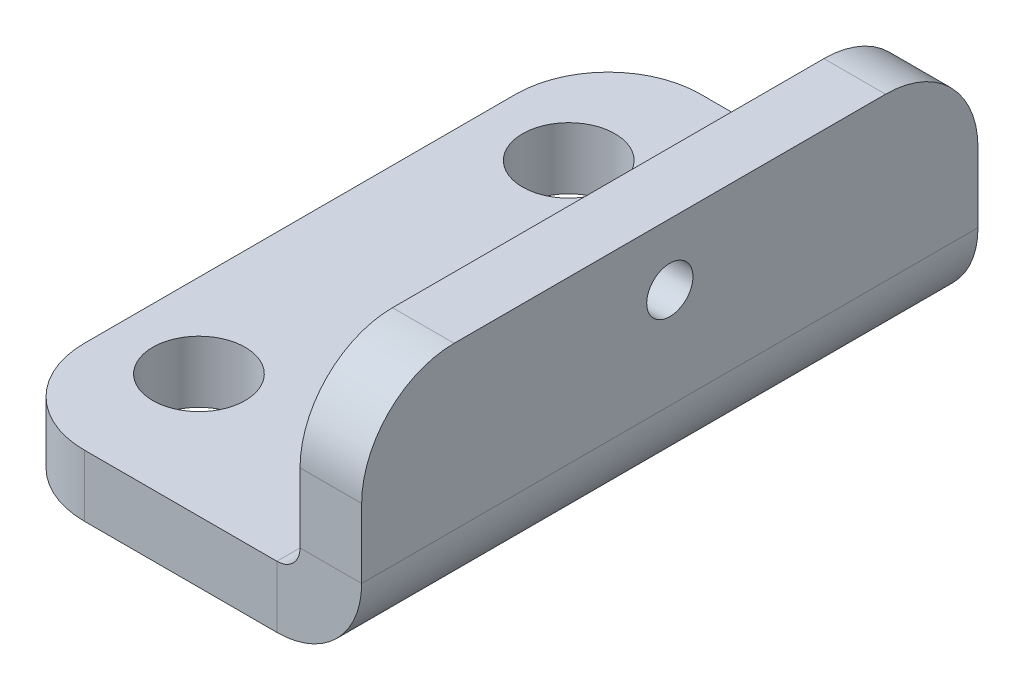
ISO-10303-21;
HEADER;
FILE_DESCRIPTION(('STEP AP214'),'2;1');
FILE_NAME('part.step','',(''),(''),'','','');
FILE_SCHEMA(('AUTOMOTIVE_DESIGN { 1 0 10303 214 1 1 1 1 }'));
ENDSEC;
DATA;
#1=APPLICATION_CONTEXT('core data for automotive mechanical design processes');
#2=APPLICATION_PROTOCOL_DEFINITION('international standard','automotive_design',2000,#1);
#3=PRODUCT_CONTEXT('',#1,'mechanical');
#4=PRODUCT('Part','Part','',(#3));
#5=PRODUCT_RELATED_PRODUCT_CATEGORY('part','',(#4));
#6=PRODUCT_DEFINITION_FORMATION('','',#4);
#7=PRODUCT_DEFINITION_CONTEXT('part definition',#1,'design');
#8=PRODUCT_DEFINITION('design','',#6,#7);
#9=PRODUCT_DEFINITION_SHAPE('','',#8);
#10=(LENGTH_UNIT() NAMED_UNIT(*) SI_UNIT(.MILLI.,.METRE.));
#11=(NAMED_UNIT(*) PLANE_ANGLE_UNIT() SI_UNIT($,.RADIAN.));
#12=(NAMED_UNIT(*) SI_UNIT($,.STERADIAN.) SOLID_ANGLE_UNIT());
#13=UNCERTAINTY_MEASURE_WITH_UNIT(LENGTH_MEASURE(1.E-05),#10,'distance_accuracy_value','');
#14=(GEOMETRIC_REPRESENTATION_CONTEXT(3) GLOBAL_UNCERTAINTY_ASSIGNED_CONTEXT((#13)) GLOBAL_UNIT_ASSIGNED_CONTEXT((#10,
#11,#12)) REPRESENTATION_CONTEXT('',''));
#15=CARTESIAN_POINT('',(0.,0.,0.));
#16=DIRECTION('',(0.,0.,1.));
#17=DIRECTION('',(1.,0.,0.));
#18=AXIS2_PLACEMENT_3D('',#15,#16,#17);
#19=CARTESIAN_POINT('',(3.,2.,7.));
#20=DIRECTION('',(0.,1.,0.));
#21=DIRECTION('',(0.,0.,1.));
#22=AXIS2_PLACEMENT_3D('',#19,#20,#21);
#23=PLANE('',#22);
#24=CARTESIAN_POINT('',(2.72,2.,-6.));
#25=DIRECTION('',(0.,1.,0.));
#26=DIRECTION('',(0.,0.,1.));
#27=AXIS2_PLACEMENT_3D('',#24,#25,#26);
#28=CIRCLE('',#27,1.5);
#29=CARTESIAN_POINT('',(2.72,2.,-4.5));
#30=VERTEX_POINT('',#29);
#31=EDGE_CURVE('E218',#30,#30,#28,.T.);
#32=ORIENTED_EDGE('',*,*,#31,.F.);
#33=EDGE_LOOP('',(#32));
#34=FACE_BOUND('',#33,.T.);
#35=CARTESIAN_POINT('',(2.72,2.,6.));
#36=DIRECTION('',(0.,1.,0.));
#37=DIRECTION('',(0.,0.,1.));
#38=AXIS2_PLACEMENT_3D('',#35,#36,#37);
#39=CIRCLE('',#38,1.5);
#40=CARTESIAN_POINT('',(2.72,2.,7.5));
#41=VERTEX_POINT('',#40);
#42=EDGE_CURVE('E212',#41,#41,#39,.T.);
#43=ORIENTED_EDGE('',*,*,#42,.F.);
#44=EDGE_LOOP('',(#43));
#45=FACE_BOUND('',#44,.T.);
#46=DIRECTION('',(1.,0.,0.));
#47=VECTOR('',#46,1.);
#48=CARTESIAN_POINT('',(3.,2.,10.));
#49=LINE('',#48,#47);
#50=CARTESIAN_POINT('',(3.,2.,10.));
#51=VERTEX_POINT('',#50);
#52=CARTESIAN_POINT('',(9.25,2.,10.));
#53=VERTEX_POINT('',#52);
#54=EDGE_CURVE('E233',#51,#53,#49,.T.);
#55=ORIENTED_EDGE('',*,*,#54,.T.);
#56=DIRECTION('',(0.,0.,-1.));
#57=VECTOR('',#56,1.);
#58=CARTESIAN_POINT('',(9.25,2.,-10.));
#59=LINE('',#58,#57);
#60=CARTESIAN_POINT('',(9.25,2.,-10.));
#61=VERTEX_POINT('',#60);
#62=EDGE_CURVE('E202',#61,#53,#59,.F.);
#63=ORIENTED_EDGE('',*,*,#62,.F.);
#64=DIRECTION('',(-1.,0.,0.));
#65=VECTOR('',#64,1.);
#66=CARTESIAN_POINT('',(3.,2.,-10.));
#67=LINE('',#66,#65);
#68=CARTESIAN_POINT('',(3.,2.,-10.));
#69=VERTEX_POINT('',#68);
#70=EDGE_CURVE('E224',#61,#69,#67,.T.);
#71=ORIENTED_EDGE('',*,*,#70,.T.);
#72=CARTESIAN_POINT('',(3.,2.,-7.));
#73=DIRECTION('',(0.,1.,0.));
#74=DIRECTION('',(0.,0.,-1.));
#75=AXIS2_PLACEMENT_3D('',#72,#73,#74);
#76=CIRCLE('',#75,3.);
#77=CARTESIAN_POINT('',(0.,2.,-7.));
#78=VERTEX_POINT('',#77);
#79=EDGE_CURVE('E226',#69,#78,#76,.T.);
#80=ORIENTED_EDGE('',*,*,#79,.T.);
#81=DIRECTION('',(0.,0.,1.));
#82=VECTOR('',#81,1.);
#83=CARTESIAN_POINT('',(0.,2.,-7.));
#84=LINE('',#83,#82);
#85=CARTESIAN_POINT('',(0.,2.,7.));
#86=VERTEX_POINT('',#85);
#87=EDGE_CURVE('E229',#78,#86,#84,.T.);
#88=ORIENTED_EDGE('',*,*,#87,.T.);
#89=CARTESIAN_POINT('',(3.,2.,7.));
#90=DIRECTION('',(0.,1.,0.));
#91=DIRECTION('',(0.,0.,1.));
#92=AXIS2_PLACEMENT_3D('',#89,#90,#91);
#93=CIRCLE('',#92,3.);
#94=EDGE_CURVE('E231',#86,#51,#93,.T.);
#95=ORIENTED_EDGE('',*,*,#94,.T.);
#96=EDGE_LOOP('',(#55,#63,#71,#80,#88,#95));
#97=FACE_BOUND('',#96,.T.);
#98=ADVANCED_FACE('F58',(#34,#45,#97),#23,.T.);
#99=CARTESIAN_POINT('',(3.,0.,7.));
#100=DIRECTION('',(0.,1.,0.));
#101=DIRECTION('',(0.,0.,1.));
#102=AXIS2_PLACEMENT_3D('',#99,#100,#101);
#103=PLANE('',#102);
#104=CARTESIAN_POINT('',(2.72,0.,6.));
#105=DIRECTION('',(0.,1.,0.));
#106=DIRECTION('',(0.,0.,1.));
#107=AXIS2_PLACEMENT_3D('',#104,#105,#106);
#108=CIRCLE('',#107,1.5);
#109=CARTESIAN_POINT('',(2.72,0.,7.5));
#110=VERTEX_POINT('',#109);
#111=EDGE_CURVE('E209',#110,#110,#108,.T.);
#112=ORIENTED_EDGE('',*,*,#111,.T.);
#113=EDGE_LOOP('',(#112));
#114=FACE_BOUND('',#113,.T.);
#115=CARTESIAN_POINT('',(2.72,0.,-6.));
#116=DIRECTION('',(0.,1.,0.));
#117=DIRECTION('',(0.,0.,1.));
#118=AXIS2_PLACEMENT_3D('',#115,#116,#117);
#119=CIRCLE('',#118,1.5);
#120=CARTESIAN_POINT('',(2.72,0.,-4.5));
#121=VERTEX_POINT('',#120);
#122=EDGE_CURVE('E215',#121,#121,#119,.T.);
#123=ORIENTED_EDGE('',*,*,#122,.T.);
#124=EDGE_LOOP('',(#123));
#125=FACE_BOUND('',#124,.T.);
#126=DIRECTION('',(0.,0.,-1.));
#127=VECTOR('',#126,1.);
#128=CARTESIAN_POINT('',(9.25,0.,-10.));
#129=LINE('',#128,#127);
#130=CARTESIAN_POINT('',(9.25,0.,-10.));
#131=VERTEX_POINT('',#130);
#132=CARTESIAN_POINT('',(9.25,0.,10.));
#133=VERTEX_POINT('',#132);
#134=EDGE_CURVE('E158',#131,#133,#129,.F.);
#135=ORIENTED_EDGE('',*,*,#134,.T.);
#136=DIRECTION('',(1.,0.,0.));
#137=VECTOR('',#136,1.);
#138=CARTESIAN_POINT('',(3.,0.,10.));
#139=LINE('',#138,#137);
#140=CARTESIAN_POINT('',(3.,0.,10.));
#141=VERTEX_POINT('',#140);
#142=EDGE_CURVE('E227',#141,#133,#139,.T.);
#143=ORIENTED_EDGE('',*,*,#142,.F.);
#144=CARTESIAN_POINT('',(3.,0.,7.));
#145=DIRECTION('',(0.,1.,0.));
#146=DIRECTION('',(0.,0.,1.));
#147=AXIS2_PLACEMENT_3D('',#144,#145,#146);
#148=CIRCLE('',#147,3.);
#149=CARTESIAN_POINT('',(0.,0.,7.));
#150=VERTEX_POINT('',#149);
#151=EDGE_CURVE('E242',#150,#141,#148,.T.);
#152=ORIENTED_EDGE('',*,*,#151,.F.);
#153=DIRECTION('',(0.,0.,1.));
#154=VECTOR('',#153,1.);
#155=CARTESIAN_POINT('',(0.,0.,-7.));
#156=LINE('',#155,#154);
#157=CARTESIAN_POINT('',(0.,0.,-7.));
#158=VERTEX_POINT('',#157);
#159=EDGE_CURVE('E240',#158,#150,#156,.T.);
#160=ORIENTED_EDGE('',*,*,#159,.F.);
#161=CARTESIAN_POINT('',(3.,0.,-7.));
#162=DIRECTION('',(0.,1.,0.));
#163=DIRECTION('',(0.,0.,-1.));
#164=AXIS2_PLACEMENT_3D('',#161,#162,#163);
#165=CIRCLE('',#164,3.);
#166=CARTESIAN_POINT('',(3.,0.,-10.));
#167=VERTEX_POINT('',#166);
#168=EDGE_CURVE('E238',#167,#158,#165,.T.);
#169=ORIENTED_EDGE('',*,*,#168,.F.);
#170=DIRECTION('',(-1.,0.,0.));
#171=VECTOR('',#170,1.);
#172=CARTESIAN_POINT('',(3.,0.,-10.));
#173=LINE('',#172,#171);
#174=EDGE_CURVE('E221',#131,#167,#173,.T.);
#175=ORIENTED_EDGE('',*,*,#174,.F.);
#176=EDGE_LOOP('',(#135,#143,#152,#160,#169,#175));
#177=FACE_BOUND('',#176,.T.);
#178=ADVANCED_FACE('F302',(#114,#125,#177),#103,.F.);
#179=CARTESIAN_POINT('',(3.,2.,-10.));
#180=DIRECTION('',(0.,0.,1.));
#181=DIRECTION('',(1.,0.,0.));
#182=AXIS2_PLACEMENT_3D('',#179,#180,#181);
#183=PLANE('',#182);
#184=DIRECTION('',(0.,-1.,0.));
#185=VECTOR('',#184,1.);
#186=CARTESIAN_POINT('',(9.25,2.,-10.));
#187=LINE('',#186,#185);
#188=EDGE_CURVE('E198',#61,#131,#187,.T.);
#189=ORIENTED_EDGE('',*,*,#188,.T.);
#190=ORIENTED_EDGE('',*,*,#174,.T.);
#191=DIRECTION('',(0.,-1.,0.));
#192=VECTOR('',#191,1.);
#193=CARTESIAN_POINT('',(3.,2.,-10.));
#194=LINE('',#193,#192);
#195=EDGE_CURVE('E253',#69,#167,#194,.T.);
#196=ORIENTED_EDGE('',*,*,#195,.F.);
#197=ORIENTED_EDGE('',*,*,#70,.F.);
#198=EDGE_LOOP('',(#189,#190,#196,#197));
#199=FACE_BOUND('',#198,.T.);
#200=ADVANCED_FACE('F307',(#199),#183,.F.);
#201=CARTESIAN_POINT('',(3.,2.,10.));
#202=DIRECTION('',(0.,0.,-1.));
#203=DIRECTION('',(-1.,0.,0.));
#204=AXIS2_PLACEMENT_3D('',#201,#202,#203);
#205=PLANE('',#204);
#206=DIRECTION('',(0.,-1.,0.));
#207=VECTOR('',#206,1.);
#208=CARTESIAN_POINT('',(9.25,2.,10.));
#209=LINE('',#208,#207);
#210=EDGE_CURVE('E206',#53,#133,#209,.T.);
#211=ORIENTED_EDGE('',*,*,#210,.F.);
#212=ORIENTED_EDGE('',*,*,#54,.F.);
#213=DIRECTION('',(0.,-1.,0.));
#214=VECTOR('',#213,1.);
#215=CARTESIAN_POINT('',(3.,2.,10.));
#216=LINE('',#215,#214);
#217=EDGE_CURVE('E236',#51,#141,#216,.T.);
#218=ORIENTED_EDGE('',*,*,#217,.T.);
#219=ORIENTED_EDGE('',*,*,#142,.T.);
#220=EDGE_LOOP('',(#211,#212,#218,#219));
#221=FACE_BOUND('',#220,.T.);
#222=ADVANCED_FACE('F290',(#221),#205,.F.);
#223=CARTESIAN_POINT('',(3.,2.,-7.));
#224=DIRECTION('',(0.,-1.,0.));
#225=DIRECTION('',(0.,0.,-1.));
#226=AXIS2_PLACEMENT_3D('',#223,#224,#225);
#227=CYLINDRICAL_SURFACE('',#226,3.);
#228=ORIENTED_EDGE('',*,*,#168,.T.);
#229=DIRECTION('',(0.,-1.,0.));
#230=VECTOR('',#229,1.);
#231=CARTESIAN_POINT('',(0.,2.,-7.));
#232=LINE('',#231,#230);
#233=EDGE_CURVE('E250',#78,#158,#232,.T.);
#234=ORIENTED_EDGE('',*,*,#233,.F.);
#235=ORIENTED_EDGE('',*,*,#79,.F.);
#236=ORIENTED_EDGE('',*,*,#195,.T.);
#237=EDGE_LOOP('',(#228,#234,#235,#236));
#238=FACE_BOUND('',#237,.T.);
#239=ADVANCED_FACE('F311',(#238),#227,.T.);
#240=CARTESIAN_POINT('',(0.,2.,-7.));
#241=DIRECTION('',(1.,0.,0.));
#242=DIRECTION('',(0.,0.,-1.));
#243=AXIS2_PLACEMENT_3D('',#240,#241,#242);
#244=PLANE('',#243);
#245=ORIENTED_EDGE('',*,*,#159,.T.);
#246=DIRECTION('',(0.,-1.,0.));
#247=VECTOR('',#246,1.);
#248=CARTESIAN_POINT('',(0.,2.,7.));
#249=LINE('',#248,#247);
#250=EDGE_CURVE('E247',#86,#150,#249,.T.);
#251=ORIENTED_EDGE('',*,*,#250,.F.);
#252=ORIENTED_EDGE('',*,*,#87,.F.);
#253=ORIENTED_EDGE('',*,*,#233,.T.);
#254=EDGE_LOOP('',(#245,#251,#252,#253));
#255=FACE_BOUND('',#254,.T.);
#256=ADVANCED_FACE('F313',(#255),#244,.F.);
#257=CARTESIAN_POINT('',(3.,2.,7.));
#258=DIRECTION('',(0.,-1.,0.));
#259=DIRECTION('',(0.,0.,-1.));
#260=AXIS2_PLACEMENT_3D('',#257,#258,#259);
#261=CYLINDRICAL_SURFACE('',#260,3.);
#262=ORIENTED_EDGE('',*,*,#151,.T.);
#263=ORIENTED_EDGE('',*,*,#217,.F.);
#264=ORIENTED_EDGE('',*,*,#94,.F.);
#265=ORIENTED_EDGE('',*,*,#250,.T.);
#266=EDGE_LOOP('',(#262,#263,#264,#265));
#267=FACE_BOUND('',#266,.T.);
#268=ADVANCED_FACE('F299',(#267),#261,.T.);
#269=CARTESIAN_POINT('',(2.72,2.,-6.));
#270=DIRECTION('',(0.,-1.,0.));
#271=DIRECTION('',(0.,0.,-1.));
#272=AXIS2_PLACEMENT_3D('',#269,#270,#271);
#273=CYLINDRICAL_SURFACE('',#272,1.5);
#274=ORIENTED_EDGE('',*,*,#31,.T.);
#275=EDGE_LOOP('',(#274));
#276=FACE_BOUND('',#275,.T.);
#277=ORIENTED_EDGE('',*,*,#122,.F.);
#278=EDGE_LOOP('',(#277));
#279=FACE_BOUND('',#278,.T.);
#280=ADVANCED_FACE('F320',(#276,#279),#273,.F.);
#281=CARTESIAN_POINT('',(2.72,2.,6.));
#282=DIRECTION('',(0.,-1.,0.));
#283=DIRECTION('',(0.,0.,-1.));
#284=AXIS2_PLACEMENT_3D('',#281,#282,#283);
#285=CYLINDRICAL_SURFACE('',#284,1.5);
#286=ORIENTED_EDGE('',*,*,#42,.T.);
#287=EDGE_LOOP('',(#286));
#288=FACE_BOUND('',#287,.T.);
#289=ORIENTED_EDGE('',*,*,#111,.F.);
#290=EDGE_LOOP('',(#289));
#291=FACE_BOUND('',#290,.T.);
#292=ADVANCED_FACE('F374',(#288,#291),#285,.F.);
#293=CARTESIAN_POINT('',(9.25,2.75,10.));
#294=DIRECTION('',(0.,0.,1.));
#295=DIRECTION('',(1.,0.,0.));
#296=AXIS2_PLACEMENT_3D('',#293,#294,#295);
#297=PLANE('',#296);
#298=DIRECTION('',(-1.,0.,0.));
#299=VECTOR('',#298,1.);
#300=CARTESIAN_POINT('',(12.,2.74999999999999,10.));
#301=LINE('',#300,#299);
#302=CARTESIAN_POINT('',(10.,2.75,10.));
#303=VERTEX_POINT('',#302);
#304=CARTESIAN_POINT('',(12.,2.74999999999999,10.));
#305=VERTEX_POINT('',#304);
#306=EDGE_CURVE('E192',#303,#305,#301,.F.);
#307=ORIENTED_EDGE('',*,*,#306,.F.);
#308=CARTESIAN_POINT('',(9.25,2.75,10.));
#309=DIRECTION('',(0.,0.,-1.));
#310=DIRECTION('',(-1.,0.,0.));
#311=AXIS2_PLACEMENT_3D('',#308,#309,#310);
#312=CIRCLE('',#311,0.750000000000002);
#313=EDGE_CURVE('E161',#53,#303,#312,.F.);
#314=ORIENTED_EDGE('',*,*,#313,.F.);
#315=ORIENTED_EDGE('',*,*,#210,.T.);
#316=CARTESIAN_POINT('',(9.25,2.75,10.));
#317=DIRECTION('',(0.,0.,-1.));
#318=DIRECTION('',(-1.,0.,0.));
#319=AXIS2_PLACEMENT_3D('',#316,#317,#318);
#320=CIRCLE('',#319,2.75);
#321=EDGE_CURVE('E197',#133,#305,#320,.F.);
#322=ORIENTED_EDGE('',*,*,#321,.T.);
#323=EDGE_LOOP('',(#307,#314,#315,#322));
#324=FACE_BOUND('',#323,.T.);
#325=ADVANCED_FACE('F287',(#324),#297,.T.);
#326=CARTESIAN_POINT('',(9.25,2.75,-10.));
#327=DIRECTION('',(0.,0.,1.));
#328=DIRECTION('',(1.,0.,0.));
#329=AXIS2_PLACEMENT_3D('',#326,#327,#328);
#330=PLANE('',#329);
#331=CARTESIAN_POINT('',(9.25,2.75,-10.));
#332=DIRECTION('',(0.,0.,-1.));
#333=DIRECTION('',(-1.,0.,0.));
#334=AXIS2_PLACEMENT_3D('',#331,#332,#333);
#335=CIRCLE('',#334,0.750000000000002);
#336=CARTESIAN_POINT('',(10.,2.75,-10.));
#337=VERTEX_POINT('',#336);
#338=EDGE_CURVE('E168',#337,#61,#335,.T.);
#339=ORIENTED_EDGE('',*,*,#338,.F.);
#340=DIRECTION('',(-1.,0.,0.));
#341=VECTOR('',#340,1.);
#342=CARTESIAN_POINT('',(10.,2.75,-10.));
#343=LINE('',#342,#341);
#344=CARTESIAN_POINT('',(12.,2.74999999999999,-10.));
#345=VERTEX_POINT('',#344);
#346=EDGE_CURVE('E165',#337,#345,#343,.F.);
#347=ORIENTED_EDGE('',*,*,#346,.T.);
#348=CARTESIAN_POINT('',(9.25,2.75,-10.));
#349=DIRECTION('',(0.,0.,-1.));
#350=DIRECTION('',(-1.,0.,0.));
#351=AXIS2_PLACEMENT_3D('',#348,#349,#350);
#352=CIRCLE('',#351,2.75);
#353=EDGE_CURVE('E150',#345,#131,#352,.T.);
#354=ORIENTED_EDGE('',*,*,#353,.T.);
#355=ORIENTED_EDGE('',*,*,#188,.F.);
#356=EDGE_LOOP('',(#339,#347,#354,#355));
#357=FACE_BOUND('',#356,.T.);
#358=ADVANCED_FACE('F166',(#357),#330,.F.);
#359=CARTESIAN_POINT('',(9.25,2.75,-10.));
#360=DIRECTION('',(0.,0.,-1.));
#361=DIRECTION('',(1.,0.,0.));
#362=AXIS2_PLACEMENT_3D('',#359,#360,#361);
#363=CYLINDRICAL_SURFACE('',#362,2.75);
#364=ORIENTED_EDGE('',*,*,#134,.F.);
#365=ORIENTED_EDGE('',*,*,#353,.F.);
#366=DIRECTION('',(0.,0.,-1.));
#367=VECTOR('',#366,1.);
#368=CARTESIAN_POINT('',(12.,2.74999999999999,10.));
#369=LINE('',#368,#367);
#370=EDGE_CURVE('E155',#345,#305,#369,.F.);
#371=ORIENTED_EDGE('',*,*,#370,.T.);
#372=ORIENTED_EDGE('',*,*,#321,.F.);
#373=EDGE_LOOP('',(#364,#365,#371,#372));
#374=FACE_BOUND('',#373,.T.);
#375=ADVANCED_FACE('F152',(#374),#363,.T.);
#376=CARTESIAN_POINT('',(9.25,2.75,-10.));
#377=DIRECTION('',(0.,0.,-1.));
#378=DIRECTION('',(1.,0.,0.));
#379=AXIS2_PLACEMENT_3D('',#376,#377,#378);
#380=CYLINDRICAL_SURFACE('',#379,0.750000000000002);
#381=ORIENTED_EDGE('',*,*,#62,.T.);
#382=ORIENTED_EDGE('',*,*,#313,.T.);
#383=DIRECTION('',(0.,0.,-1.));
#384=VECTOR('',#383,1.);
#385=CARTESIAN_POINT('',(10.,2.75,10.));
#386=LINE('',#385,#384);
#387=EDGE_CURVE('E170',#303,#337,#386,.T.);
#388=ORIENTED_EDGE('',*,*,#387,.T.);
#389=ORIENTED_EDGE('',*,*,#338,.T.);
#390=EDGE_LOOP('',(#381,#382,#388,#389));
#391=FACE_BOUND('',#390,.T.);
#392=ADVANCED_FACE('F284',(#391),#380,.F.);
#393=CARTESIAN_POINT('',(12.,8.,-10.));
#394=DIRECTION('',(0.,0.,1.));
#395=DIRECTION('',(0.,-1.,0.));
#396=AXIS2_PLACEMENT_3D('',#393,#394,#395);
#397=PLANE('',#396);
#398=DIRECTION('',(0.,-1.,0.));
#399=VECTOR('',#398,1.);
#400=CARTESIAN_POINT('',(10.,8.00000000000001,-10.));
#401=LINE('',#400,#399);
#402=CARTESIAN_POINT('',(10.,5.00000000000001,-10.));
#403=VERTEX_POINT('',#402);
#404=EDGE_CURVE('E178',#337,#403,#401,.F.);
#405=ORIENTED_EDGE('',*,*,#404,.T.);
#406=DIRECTION('',(-1.,0.,0.));
#407=VECTOR('',#406,1.);
#408=CARTESIAN_POINT('',(12.,5.,-10.));
#409=LINE('',#408,#407);
#410=CARTESIAN_POINT('',(12.,5.,-10.));
#411=VERTEX_POINT('',#410);
#412=EDGE_CURVE('E13',#403,#411,#409,.F.);
#413=ORIENTED_EDGE('',*,*,#412,.T.);
#414=DIRECTION('',(0.,1.,0.));
#415=VECTOR('',#414,1.);
#416=CARTESIAN_POINT('',(12.,0.,-10.));
#417=LINE('',#416,#415);
#418=EDGE_CURVE('E174',#345,#411,#417,.T.);
#419=ORIENTED_EDGE('',*,*,#418,.F.);
#420=ORIENTED_EDGE('',*,*,#346,.F.);
#421=EDGE_LOOP('',(#405,#413,#419,#420));
#422=FACE_BOUND('',#421,.T.);
#423=ADVANCED_FACE('F180',(#422),#397,.F.);
#424=CARTESIAN_POINT('',(12.,1.99999999999999,10.));
#425=DIRECTION('',(0.,0.,-1.));
#426=DIRECTION('',(0.,1.,0.));
#427=AXIS2_PLACEMENT_3D('',#424,#425,#426);
#428=PLANE('',#427);
#429=DIRECTION('',(0.,-1.,0.));
#430=VECTOR('',#429,1.);
#431=CARTESIAN_POINT('',(12.,0.,10.));
#432=LINE('',#431,#430);
#433=CARTESIAN_POINT('',(12.,5.,10.));
#434=VERTEX_POINT('',#433);
#435=EDGE_CURVE('E177',#434,#305,#432,.T.);
#436=ORIENTED_EDGE('',*,*,#435,.F.);
#437=DIRECTION('',(-1.,0.,0.));
#438=VECTOR('',#437,1.);
#439=CARTESIAN_POINT('',(12.,5.,10.));
#440=LINE('',#439,#438);
#441=CARTESIAN_POINT('',(10.,5.00000000000001,10.));
#442=VERTEX_POINT('',#441);
#443=EDGE_CURVE('E256',#434,#442,#440,.T.);
#444=ORIENTED_EDGE('',*,*,#443,.T.);
#445=DIRECTION('',(0.,1.,0.));
#446=VECTOR('',#445,1.);
#447=CARTESIAN_POINT('',(10.,2.,10.));
#448=LINE('',#447,#446);
#449=EDGE_CURVE('E182',#442,#303,#448,.F.);
#450=ORIENTED_EDGE('',*,*,#449,.T.);
#451=ORIENTED_EDGE('',*,*,#306,.T.);
#452=EDGE_LOOP('',(#436,#444,#450,#451));
#453=FACE_BOUND('',#452,.T.);
#454=ADVANCED_FACE('F272',(#453),#428,.F.);
#455=CARTESIAN_POINT('',(12.,0.,0.));
#456=DIRECTION('',(-1.,0.,0.));
#457=DIRECTION('',(0.,-1.,0.));
#458=AXIS2_PLACEMENT_3D('',#455,#456,#457);
#459=PLANE('',#458);
#460=CARTESIAN_POINT('',(12.,6.,0.));
#461=DIRECTION('',(-1.,0.,0.));
#462=DIRECTION('',(0.,-1.,0.));
#463=AXIS2_PLACEMENT_3D('',#460,#461,#462);
#464=CIRCLE('',#463,0.75);
#465=CARTESIAN_POINT('',(12.,5.25,0.));
#466=VERTEX_POINT('',#465);
#467=EDGE_CURVE('E195',#466,#466,#464,.T.);
#468=ORIENTED_EDGE('',*,*,#467,.T.);
#469=EDGE_LOOP('',(#468));
#470=FACE_BOUND('',#469,.T.);
#471=DIRECTION('',(0.,0.,1.));
#472=VECTOR('',#471,1.);
#473=CARTESIAN_POINT('',(12.,8.,0.));
#474=LINE('',#473,#472);
#475=CARTESIAN_POINT('',(12.,8.,-7.));
#476=VERTEX_POINT('',#475);
#477=CARTESIAN_POINT('',(12.,8.,7.));
#478=VERTEX_POINT('',#477);
#479=EDGE_CURVE('E181',#476,#478,#474,.T.);
#480=ORIENTED_EDGE('',*,*,#479,.T.);
#481=CARTESIAN_POINT('',(12.,5.,7.));
#482=DIRECTION('',(-1.,0.,0.));
#483=DIRECTION('',(0.,-1.,0.));
#484=AXIS2_PLACEMENT_3D('',#481,#482,#483);
#485=CIRCLE('',#484,3.);
#486=EDGE_CURVE('E66',#478,#434,#485,.F.);
#487=ORIENTED_EDGE('',*,*,#486,.T.);
#488=ORIENTED_EDGE('',*,*,#435,.T.);
#489=ORIENTED_EDGE('',*,*,#370,.F.);
#490=ORIENTED_EDGE('',*,*,#418,.T.);
#491=CARTESIAN_POINT('',(12.,5.,-7.));
#492=DIRECTION('',(-1.,0.,0.));
#493=DIRECTION('',(0.,-1.,0.));
#494=AXIS2_PLACEMENT_3D('',#491,#492,#493);
#495=CIRCLE('',#494,3.);
#496=EDGE_CURVE('E267',#411,#476,#495,.F.);
#497=ORIENTED_EDGE('',*,*,#496,.T.);
#498=EDGE_LOOP('',(#480,#487,#488,#489,#490,#497));
#499=FACE_BOUND('',#498,.T.);
#500=ADVANCED_FACE('F173',(#470,#499),#459,.F.);
#501=CARTESIAN_POINT('',(9.99999999999999,0.,0.));
#502=DIRECTION('',(-1.,0.,0.));
#503=DIRECTION('',(0.,-1.,0.));
#504=AXIS2_PLACEMENT_3D('',#501,#502,#503);
#505=PLANE('',#504);
#506=CARTESIAN_POINT('',(10.,6.00000000000001,0.));
#507=DIRECTION('',(-1.,0.,0.));
#508=DIRECTION('',(0.,-1.,0.));
#509=AXIS2_PLACEMENT_3D('',#506,#507,#508);
#510=CIRCLE('',#509,0.75);
#511=CARTESIAN_POINT('',(10.,5.25000000000001,0.));
#512=VERTEX_POINT('',#511);
#513=EDGE_CURVE('E539',#512,#512,#510,.T.);
#514=ORIENTED_EDGE('',*,*,#513,.F.);
#515=EDGE_LOOP('',(#514));
#516=FACE_BOUND('',#515,.T.);
#517=ORIENTED_EDGE('',*,*,#449,.F.);
#518=CARTESIAN_POINT('',(10.,5.00000000000001,7.));
#519=DIRECTION('',(-1.,0.,0.));
#520=DIRECTION('',(0.,-1.,0.));
#521=AXIS2_PLACEMENT_3D('',#518,#519,#520);
#522=CIRCLE('',#521,3.);
#523=CARTESIAN_POINT('',(10.,8.00000000000001,7.));
#524=VERTEX_POINT('',#523);
#525=EDGE_CURVE('E261',#442,#524,#522,.T.);
#526=ORIENTED_EDGE('',*,*,#525,.T.);
#527=DIRECTION('',(0.,0.,-1.));
#528=VECTOR('',#527,1.);
#529=CARTESIAN_POINT('',(10.,8.00000000000001,10.));
#530=LINE('',#529,#528);
#531=CARTESIAN_POINT('',(10.,8.00000000000001,-7.));
#532=VERTEX_POINT('',#531);
#533=EDGE_CURVE('E185',#532,#524,#530,.F.);
#534=ORIENTED_EDGE('',*,*,#533,.F.);
#535=CARTESIAN_POINT('',(10.,5.00000000000001,-7.));
#536=DIRECTION('',(-1.,0.,0.));
#537=DIRECTION('',(0.,-1.,0.));
#538=AXIS2_PLACEMENT_3D('',#535,#536,#537);
#539=CIRCLE('',#538,3.);
#540=EDGE_CURVE('E259',#532,#403,#539,.T.);
#541=ORIENTED_EDGE('',*,*,#540,.T.);
#542=ORIENTED_EDGE('',*,*,#404,.F.);
#543=ORIENTED_EDGE('',*,*,#387,.F.);
#544=EDGE_LOOP('',(#517,#526,#534,#541,#542,#543));
#545=FACE_BOUND('',#544,.T.);
#546=ADVANCED_FACE('F278',(#516,#545),#505,.T.);
#547=CARTESIAN_POINT('',(12.,8.,10.));
#548=DIRECTION('',(0.,-1.,0.));
#549=DIRECTION('',(1.,0.,0.));
#550=AXIS2_PLACEMENT_3D('',#547,#548,#549);
#551=PLANE('',#550);
#552=ORIENTED_EDGE('',*,*,#533,.T.);
#553=DIRECTION('',(-1.,0.,0.));
#554=VECTOR('',#553,1.);
#555=CARTESIAN_POINT('',(12.,8.,7.));
#556=LINE('',#555,#554);
#557=EDGE_CURVE('E79',#524,#478,#556,.F.);
#558=ORIENTED_EDGE('',*,*,#557,.T.);
#559=ORIENTED_EDGE('',*,*,#479,.F.);
#560=DIRECTION('',(-1.,0.,0.));
#561=VECTOR('',#560,1.);
#562=CARTESIAN_POINT('',(12.,8.,-7.));
#563=LINE('',#562,#561);
#564=EDGE_CURVE('E263',#476,#532,#563,.T.);
#565=ORIENTED_EDGE('',*,*,#564,.T.);
#566=EDGE_LOOP('',(#552,#558,#559,#565));
#567=FACE_BOUND('',#566,.T.);
#568=ADVANCED_FACE('F280',(#567),#551,.F.);
#569=CARTESIAN_POINT('',(20.,5.99999999999997,0.));
#570=DIRECTION('',(-1.,0.,0.));
#571=DIRECTION('',(0.,-1.,0.));
#572=AXIS2_PLACEMENT_3D('',#569,#570,#571);
#573=CYLINDRICAL_SURFACE('',#572,0.75);
#574=ORIENTED_EDGE('',*,*,#513,.T.);
#575=EDGE_LOOP('',(#574));
#576=FACE_BOUND('',#575,.T.);
#577=ORIENTED_EDGE('',*,*,#467,.F.);
#578=EDGE_LOOP('',(#577));
#579=FACE_BOUND('',#578,.T.);
#580=ADVANCED_FACE('F344',(#576,#579),#573,.F.);
#581=CARTESIAN_POINT('',(12.,5.,7.));
#582=DIRECTION('',(-1.,0.,0.));
#583=DIRECTION('',(0.,-1.,0.));
#584=AXIS2_PLACEMENT_3D('',#581,#582,#583);
#585=CYLINDRICAL_SURFACE('',#584,3.);
#586=ORIENTED_EDGE('',*,*,#486,.F.);
#587=ORIENTED_EDGE('',*,*,#557,.F.);
#588=ORIENTED_EDGE('',*,*,#525,.F.);
#589=ORIENTED_EDGE('',*,*,#443,.F.);
#590=EDGE_LOOP('',(#586,#587,#588,#589));
#591=FACE_BOUND('',#590,.T.);
#592=ADVANCED_FACE('F275',(#591),#585,.T.);
#593=CARTESIAN_POINT('',(12.,5.,-7.));
#594=DIRECTION('',(-1.,0.,0.));
#595=DIRECTION('',(0.,-1.,0.));
#596=AXIS2_PLACEMENT_3D('',#593,#594,#595);
#597=CYLINDRICAL_SURFACE('',#596,3.);
#598=ORIENTED_EDGE('',*,*,#496,.F.);
#599=ORIENTED_EDGE('',*,*,#412,.F.);
#600=ORIENTED_EDGE('',*,*,#540,.F.);
#601=ORIENTED_EDGE('',*,*,#564,.F.);
#602=EDGE_LOOP('',(#598,#599,#600,#601));
#603=FACE_BOUND('',#602,.T.);
#604=ADVANCED_FACE('F60',(#603),#597,.T.);
#605=CLOSED_SHELL('',(#98,#178,#200,#222,#239,#256,#268,#280,#292,#325,#358,#375,#392,#423,#454,
#500,#546,#568,#580,#592,#604));
#606=MANIFOLD_SOLID_BREP('B2',#605);
#607=ADVANCED_BREP_SHAPE_REPRESENTATION('',(#18,#606),#14);
#608=SHAPE_DEFINITION_REPRESENTATION(#9,#607);
ENDSEC;
END-ISO-10303-21;
